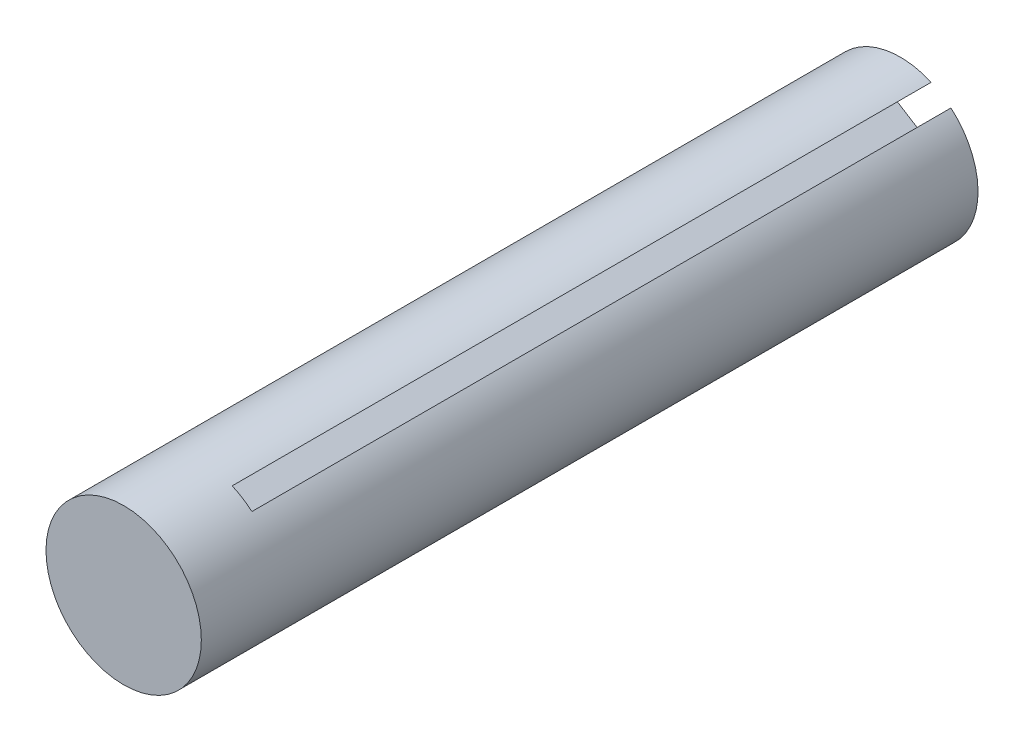
ISO-10303-21;
HEADER;
FILE_DESCRIPTION(('STEP AP214'),'2;1');
FILE_NAME('part.step','',(''),(''),'','','');
FILE_SCHEMA(('AUTOMOTIVE_DESIGN { 1 0 10303 214 1 1 1 1 }'));
ENDSEC;
DATA;
#1=APPLICATION_CONTEXT('core data for automotive mechanical design processes');
#2=APPLICATION_PROTOCOL_DEFINITION('international standard','automotive_design',2000,#1);
#3=PRODUCT_CONTEXT('',#1,'mechanical');
#4=PRODUCT('Part','Part','',(#3));
#5=PRODUCT_RELATED_PRODUCT_CATEGORY('part','',(#4));
#6=PRODUCT_DEFINITION_FORMATION('','',#4);
#7=PRODUCT_DEFINITION_CONTEXT('part definition',#1,'design');
#8=PRODUCT_DEFINITION('design','',#6,#7);
#9=PRODUCT_DEFINITION_SHAPE('','',#8);
#10=(LENGTH_UNIT() NAMED_UNIT(*) SI_UNIT(.MILLI.,.METRE.));
#11=(NAMED_UNIT(*) PLANE_ANGLE_UNIT() SI_UNIT($,.RADIAN.));
#12=(NAMED_UNIT(*) SI_UNIT($,.STERADIAN.) SOLID_ANGLE_UNIT());
#13=UNCERTAINTY_MEASURE_WITH_UNIT(LENGTH_MEASURE(1.E-05),#10,'distance_accuracy_value','');
#14=(GEOMETRIC_REPRESENTATION_CONTEXT(3) GLOBAL_UNCERTAINTY_ASSIGNED_CONTEXT((#13)) GLOBAL_UNIT_ASSIGNED_CONTEXT((#10,
#11,#12)) REPRESENTATION_CONTEXT('',''));
#15=CARTESIAN_POINT('',(0.,0.,0.));
#16=DIRECTION('',(0.,0.,1.));
#17=DIRECTION('',(1.,0.,0.));
#18=AXIS2_PLACEMENT_3D('',#15,#16,#17);
#19=CARTESIAN_POINT('',(-5.34894767701645,5.17438553068314,100.));
#20=DIRECTION('',(0.,0.,-1.));
#21=DIRECTION('',(-1.,0.,0.));
#22=AXIS2_PLACEMENT_3D('',#19,#20,#21);
#23=CYLINDRICAL_SURFACE('',#22,10.);
#24=CARTESIAN_POINT('',(-5.34894767701645,5.17438553068314,100.));
#25=DIRECTION('',(0.,0.,1.));
#26=DIRECTION('',(1.,0.,0.));
#27=AXIS2_PLACEMENT_3D('',#24,#25,#26);
#28=CIRCLE('',#27,10.);
#29=CARTESIAN_POINT('',(4.65105232298355,5.17438553068314,100.));
#30=VERTEX_POINT('',#29);
#31=EDGE_CURVE('E203',#30,#30,#28,.T.);
#32=ORIENTED_EDGE('',*,*,#31,.F.);
#33=EDGE_LOOP('',(#32));
#34=FACE_BOUND('',#33,.T.);
#35=CARTESIAN_POINT('',(-5.34894767701645,5.17438553068314,90.));
#36=DIRECTION('',(0.,0.,-1.));
#37=DIRECTION('',(-1.,0.,0.));
#38=AXIS2_PLACEMENT_3D('',#35,#36,#37);
#39=CIRCLE('',#38,10.);
#40=CARTESIAN_POINT('',(-15.2826424117407,4.02472953112816,90.));
#41=VERTEX_POINT('',#40);
#42=CARTESIAN_POINT('',(-15.1766207850004,7.02285551491592,90.));
#43=VERTEX_POINT('',#42);
#44=EDGE_CURVE('E11',#41,#43,#39,.T.);
#45=ORIENTED_EDGE('',*,*,#44,.F.);
#46=DIRECTION('',(0.,0.,-1.));
#47=VECTOR('',#46,1.);
#48=CARTESIAN_POINT('',(-15.2826424117407,4.02472953112816,90.));
#49=LINE('',#48,#47);
#50=CARTESIAN_POINT('',(-15.2826424117407,4.02472953112816,0.));
#51=VERTEX_POINT('',#50);
#52=EDGE_CURVE('E184',#41,#51,#49,.T.);
#53=ORIENTED_EDGE('',*,*,#52,.T.);
#54=CARTESIAN_POINT('',(-5.34894767701645,5.17438553068314,0.));
#55=DIRECTION('',(0.,0.,1.));
#56=DIRECTION('',(1.,0.,0.));
#57=AXIS2_PLACEMENT_3D('',#54,#55,#56);
#58=CIRCLE('',#57,10.);
#59=CARTESIAN_POINT('',(-2.03593308750304,-4.26086403303648,0.));
#60=VERTEX_POINT('',#59);
#61=EDGE_CURVE('E208',#51,#60,#58,.T.);
#62=ORIENTED_EDGE('',*,*,#61,.T.);
#63=DIRECTION('',(0.,0.,-1.));
#64=VECTOR('',#63,1.);
#65=CARTESIAN_POINT('',(-2.03593308750304,-4.26086403303648,90.));
#66=LINE('',#65,#64);
#67=CARTESIAN_POINT('',(-2.03593308750304,-4.26086403303648,90.));
#68=VERTEX_POINT('',#67);
#69=EDGE_CURVE('E46',#68,#60,#66,.T.);
#70=ORIENTED_EDGE('',*,*,#69,.F.);
#71=CARTESIAN_POINT('',(-5.34894767701645,5.17438553068314,90.));
#72=DIRECTION('',(0.,0.,-1.));
#73=DIRECTION('',(-1.,0.,0.));
#74=AXIS2_PLACEMENT_3D('',#71,#72,#73);
#75=CIRCLE('',#74,10.);
#76=CARTESIAN_POINT('',(0.6135309915735,-2.8536184632502,90.));
#77=VERTEX_POINT('',#76);
#78=EDGE_CURVE('E39',#77,#68,#75,.T.);
#79=ORIENTED_EDGE('',*,*,#78,.F.);
#80=DIRECTION('',(0.,0.,-1.));
#81=VECTOR('',#80,1.);
#82=CARTESIAN_POINT('',(0.6135309915735,-2.8536184632502,90.));
#83=LINE('',#82,#81);
#84=CARTESIAN_POINT('',(0.6135309915735,-2.8536184632502,0.));
#85=VERTEX_POINT('',#84);
#86=EDGE_CURVE('E161',#77,#85,#83,.T.);
#87=ORIENTED_EDGE('',*,*,#86,.T.);
#88=CARTESIAN_POINT('',(1.16571084145416,12.76116511017,0.));
#89=VERTEX_POINT('',#88);
#90=EDGE_CURVE('E200',#85,#89,#58,.T.);
#91=ORIENTED_EDGE('',*,*,#90,.T.);
#92=DIRECTION('',(0.,0.,-1.));
#93=VECTOR('',#92,1.);
#94=CARTESIAN_POINT('',(1.16571084145416,12.76116511017,90.));
#95=LINE('',#94,#93);
#96=CARTESIAN_POINT('',(1.16571084145416,12.76116511017,90.));
#97=VERTEX_POINT('',#96);
#98=EDGE_CURVE('E179',#97,#89,#95,.T.);
#99=ORIENTED_EDGE('',*,*,#98,.F.);
#100=CARTESIAN_POINT('',(-5.34894767701645,5.17438553068314,90.));
#101=DIRECTION('',(0.,0.,-1.));
#102=DIRECTION('',(-1.,0.,0.));
#103=AXIS2_PLACEMENT_3D('',#100,#101,#102);
#104=CIRCLE('',#103,10.);
#105=CARTESIAN_POINT('',(-1.37773161088211,14.3520455241715,90.));
#106=VERTEX_POINT('',#105);
#107=EDGE_CURVE('E206',#106,#97,#104,.T.);
#108=ORIENTED_EDGE('',*,*,#107,.F.);
#109=DIRECTION('',(0.,0.,-1.));
#110=VECTOR('',#109,1.);
#111=CARTESIAN_POINT('',(-1.37773161088211,14.3520455241715,90.));
#112=LINE('',#111,#110);
#113=CARTESIAN_POINT('',(-1.37773161088211,14.3520455241715,0.));
#114=VERTEX_POINT('',#113);
#115=EDGE_CURVE('E188',#106,#114,#112,.T.);
#116=ORIENTED_EDGE('',*,*,#115,.T.);
#117=CARTESIAN_POINT('',(-15.1766207850004,7.02285551491592,0.));
#118=VERTEX_POINT('',#117);
#119=EDGE_CURVE('E139',#114,#118,#58,.T.);
#120=ORIENTED_EDGE('',*,*,#119,.T.);
#121=DIRECTION('',(0.,0.,-1.));
#122=VECTOR('',#121,1.);
#123=CARTESIAN_POINT('',(-15.1766207850004,7.02285551491592,90.));
#124=LINE('',#123,#122);
#125=EDGE_CURVE('E54',#43,#118,#124,.T.);
#126=ORIENTED_EDGE('',*,*,#125,.F.);
#127=EDGE_LOOP('',(#45,#53,#62,#70,#79,#87,#91,#99,#108,#116,#120,#126));
#128=FACE_BOUND('',#127,.T.);
#129=ADVANCED_FACE('F32',(#34,#128),#23,.T.);
#130=CARTESIAN_POINT('',(-5.34894767701645,5.17438553068314,100.));
#131=DIRECTION('',(0.,0.,1.));
#132=DIRECTION('',(1.,0.,0.));
#133=AXIS2_PLACEMENT_3D('',#130,#131,#132);
#134=PLANE('',#133);
#135=ORIENTED_EDGE('',*,*,#31,.T.);
#136=EDGE_LOOP('',(#135));
#137=FACE_BOUND('',#136,.T.);
#138=ADVANCED_FACE('F260',(#137),#134,.T.);
#139=CARTESIAN_POINT('',(-5.34894767701645,5.17438553068314,0.));
#140=DIRECTION('',(0.,0.,1.));
#141=DIRECTION('',(1.,0.,0.));
#142=AXIS2_PLACEMENT_3D('',#139,#140,#141);
#143=PLANE('',#142);
#144=CARTESIAN_POINT('',(-5.34894767701645,5.17438553068314,0.));
#145=DIRECTION('',(0.,0.,-1.));
#146=DIRECTION('',(-1.,0.,0.));
#147=AXIS2_PLACEMENT_3D('',#144,#145,#146);
#148=CIRCLE('',#147,1.1);
#149=CARTESIAN_POINT('',(-6.44894767701645,5.17438553068314,0.));
#150=VERTEX_POINT('',#149);
#151=EDGE_CURVE('E190',#150,#150,#148,.T.);
#152=ORIENTED_EDGE('',*,*,#151,.F.);
#153=EDGE_LOOP('',(#152));
#154=FACE_BOUND('',#153,.T.);
#155=ORIENTED_EDGE('',*,*,#61,.F.);
#156=DIRECTION('',(-0.960965138717914,0.27666948181695,0.));
#157=VECTOR('',#156,1.);
#158=CARTESIAN_POINT('',(-9.33940125753525,2.31362328575388,0.));
#159=LINE('',#158,#157);
#160=CARTESIAN_POINT('',(-9.33940125753525,2.31362328575388,0.));
#161=VERTEX_POINT('',#160);
#162=EDGE_CURVE('E134',#161,#51,#159,.T.);
#163=ORIENTED_EDGE('',*,*,#162,.F.);
#164=DIRECTION('',(-0.0353405422467573,-0.999375327929255,0.));
#165=VECTOR('',#164,1.);
#166=CARTESIAN_POINT('',(-9.28639044416512,3.81268627764762,0.));
#167=LINE('',#166,#165);
#168=CARTESIAN_POINT('',(-9.12735800405473,8.30987525332912,0.));
#169=VERTEX_POINT('',#168);
#170=EDGE_CURVE('E240',#169,#161,#167,.T.);
#171=ORIENTED_EDGE('',*,*,#170,.F.);
#172=DIRECTION('',(0.978107819723793,0.20809875779343,0.));
#173=VECTOR('',#172,1.);
#174=CARTESIAN_POINT('',(-9.12735800405473,8.30987525332912,0.));
#175=LINE('',#174,#173);
#176=EDGE_CURVE('E164',#118,#169,#175,.T.);
#177=ORIENTED_EDGE('',*,*,#176,.F.);
#178=ORIENTED_EDGE('',*,*,#119,.F.);
#179=DIRECTION('',(0.720085369064332,0.693885481372456,0.));
#180=VECTOR('',#179,1.);
#181=CARTESIAN_POINT('',(-5.83121366505329,10.0606008264997,0.));
#182=LINE('',#181,#180);
#183=CARTESIAN_POINT('',(-5.83121366505329,10.0606008264997,0.));
#184=VERTEX_POINT('',#183);
#185=EDGE_CURVE('E174',#184,#114,#182,.T.);
#186=ORIENTED_EDGE('',*,*,#185,.F.);
#187=DIRECTION('',(-0.847814150778758,0.53029347133384,0.));
#188=VECTOR('',#187,1.);
#189=CARTESIAN_POINT('',(-4.55949243888515,9.26516061949894,0.));
#190=LINE('',#189,#188);
#191=CARTESIAN_POINT('',(-0.744328760380744,6.87883999849667,0.));
#192=VERTEX_POINT('',#191);
#193=EDGE_CURVE('E183',#192,#184,#190,.T.);
#194=ORIENTED_EDGE('',*,*,#193,.F.);
#195=DIRECTION('',(-0.308835099116785,-0.951115598417735,0.));
#196=VECTOR('',#195,1.);
#197=CARTESIAN_POINT('',(-0.744328760380744,6.87883999849667,0.));
#198=LINE('',#197,#196);
#199=EDGE_CURVE('E180',#89,#192,#198,.T.);
#200=ORIENTED_EDGE('',*,*,#199,.F.);
#201=ORIENTED_EDGE('',*,*,#90,.F.);
#202=DIRECTION('',(0.240879769653607,-0.970554963189425,0.));
#203=VECTOR('',#202,1.);
#204=CARTESIAN_POINT('',(-0.876228108460899,3.14893247979595,0.));
#205=LINE('',#204,#203);
#206=CARTESIAN_POINT('',(-0.876228108460899,3.14893247979595,0.));
#207=VERTEX_POINT('',#206);
#208=EDGE_CURVE('E150',#207,#85,#205,.T.);
#209=ORIENTED_EDGE('',*,*,#208,.F.);
#210=DIRECTION('',(0.883154693025514,0.469081856595424,0.));
#211=VECTOR('',#210,1.);
#212=CARTESIAN_POINT('',(-2.20096014799904,2.44530969490288,0.));
#213=LINE('',#212,#211);
#214=CARTESIAN_POINT('',(-6.17515626661373,0.334441340223541,0.));
#215=VERTEX_POINT('',#214);
#216=EDGE_CURVE('E157',#215,#207,#213,.T.);
#217=ORIENTED_EDGE('',*,*,#216,.F.);
#218=DIRECTION('',(-0.669272720606996,0.743016840624296,0.));
#219=VECTOR('',#218,1.);
#220=CARTESIAN_POINT('',(-6.17515626661373,0.334441340223541,0.));
#221=LINE('',#220,#219);
#222=EDGE_CURVE('E155',#60,#215,#221,.T.);
#223=ORIENTED_EDGE('',*,*,#222,.F.);
#224=EDGE_LOOP('',(#155,#163,#171,#177,#178,#186,#194,#200,#201,#209,#217,#223));
#225=FACE_BOUND('',#224,.T.);
#226=ADVANCED_FACE('F228',(#154,#225),#143,.F.);
#227=CARTESIAN_POINT('',(-5.34894767701645,5.17438553068314,4.));
#228=DIRECTION('',(0.,0.,-1.));
#229=DIRECTION('',(-1.,0.,0.));
#230=AXIS2_PLACEMENT_3D('',#227,#228,#229);
#231=CYLINDRICAL_SURFACE('',#230,1.1);
#232=CARTESIAN_POINT('',(-5.34894767701645,5.17438553068314,4.));
#233=DIRECTION('',(0.,0.,-1.));
#234=DIRECTION('',(-1.,0.,0.));
#235=AXIS2_PLACEMENT_3D('',#232,#233,#234);
#236=CIRCLE('',#235,1.1);
#237=CARTESIAN_POINT('',(-6.44894767701645,5.17438553068314,4.));
#238=VERTEX_POINT('',#237);
#239=EDGE_CURVE('E197',#238,#238,#236,.T.);
#240=ORIENTED_EDGE('',*,*,#239,.F.);
#241=EDGE_LOOP('',(#240));
#242=FACE_BOUND('',#241,.T.);
#243=ORIENTED_EDGE('',*,*,#151,.T.);
#244=EDGE_LOOP('',(#243));
#245=FACE_BOUND('',#244,.T.);
#246=ADVANCED_FACE('F271',(#242,#245),#231,.F.);
#247=CARTESIAN_POINT('',(-5.34894767701645,5.17438553068314,4.));
#248=DIRECTION('',(0.,0.,-1.));
#249=DIRECTION('',(-1.,0.,0.));
#250=AXIS2_PLACEMENT_3D('',#247,#248,#249);
#251=PLANE('',#250);
#252=ORIENTED_EDGE('',*,*,#239,.T.);
#253=EDGE_LOOP('',(#252));
#254=FACE_BOUND('',#253,.T.);
#255=ADVANCED_FACE('F276',(#254),#251,.T.);
#256=CARTESIAN_POINT('',(0.,0.,90.));
#257=DIRECTION('',(0.,0.,-1.));
#258=DIRECTION('',(-1.,0.,0.));
#259=AXIS2_PLACEMENT_3D('',#256,#257,#258);
#260=PLANE('',#259);
#261=ORIENTED_EDGE('',*,*,#107,.T.);
#262=DIRECTION('',(-0.308835099116785,-0.951115598417735,0.));
#263=VECTOR('',#262,1.);
#264=CARTESIAN_POINT('',(-0.744328760380744,6.87883999849667,90.));
#265=LINE('',#264,#263);
#266=CARTESIAN_POINT('',(-0.744328760380744,6.87883999849667,90.));
#267=VERTEX_POINT('',#266);
#268=EDGE_CURVE('E170',#97,#267,#265,.T.);
#269=ORIENTED_EDGE('',*,*,#268,.T.);
#270=DIRECTION('',(-0.847814150778757,0.530293471333841,0.));
#271=VECTOR('',#270,1.);
#272=CARTESIAN_POINT('',(-2.01604998654888,7.67428020549743,90.));
#273=LINE('',#272,#271);
#274=CARTESIAN_POINT('',(-5.83121366505329,10.0606008264997,90.));
#275=VERTEX_POINT('',#274);
#276=EDGE_CURVE('E173',#267,#275,#273,.T.);
#277=ORIENTED_EDGE('',*,*,#276,.T.);
#278=DIRECTION('',(0.720085369064332,0.693885481372456,0.));
#279=VECTOR('',#278,1.);
#280=CARTESIAN_POINT('',(-5.83121366505329,10.0606008264997,90.));
#281=LINE('',#280,#279);
#282=EDGE_CURVE('E176',#275,#106,#281,.T.);
#283=ORIENTED_EDGE('',*,*,#282,.T.);
#284=EDGE_LOOP('',(#261,#269,#277,#283));
#285=FACE_BOUND('',#284,.T.);
#286=ADVANCED_FACE('F236',(#285),#260,.T.);
#287=CARTESIAN_POINT('',(-5.83121366505329,10.0606008264997,90.));
#288=DIRECTION('',(-0.693885481372456,0.720085369064332,0.));
#289=DIRECTION('',(-0.720085369064332,-0.693885481372456,0.));
#290=AXIS2_PLACEMENT_3D('',#287,#288,#289);
#291=PLANE('',#290);
#292=ORIENTED_EDGE('',*,*,#185,.T.);
#293=ORIENTED_EDGE('',*,*,#115,.F.);
#294=ORIENTED_EDGE('',*,*,#282,.F.);
#295=DIRECTION('',(0.,0.,-1.));
#296=VECTOR('',#295,1.);
#297=CARTESIAN_POINT('',(-5.83121366505329,10.0606008264997,90.));
#298=LINE('',#297,#296);
#299=EDGE_CURVE('E191',#275,#184,#298,.T.);
#300=ORIENTED_EDGE('',*,*,#299,.T.);
#301=EDGE_LOOP('',(#292,#293,#294,#300));
#302=FACE_BOUND('',#301,.T.);
#303=ADVANCED_FACE('F285',(#302),#291,.F.);
#304=CARTESIAN_POINT('',(-4.55949243888515,9.26516061949894,90.));
#305=DIRECTION('',(-0.53029347133384,-0.847814150778758,0.));
#306=DIRECTION('',(0.847814150778758,-0.53029347133384,0.));
#307=AXIS2_PLACEMENT_3D('',#304,#305,#306);
#308=PLANE('',#307);
#309=ORIENTED_EDGE('',*,*,#193,.T.);
#310=ORIENTED_EDGE('',*,*,#299,.F.);
#311=ORIENTED_EDGE('',*,*,#276,.F.);
#312=DIRECTION('',(0.,0.,-1.));
#313=VECTOR('',#312,1.);
#314=CARTESIAN_POINT('',(-0.744328760380744,6.87883999849667,90.));
#315=LINE('',#314,#313);
#316=EDGE_CURVE('E193',#267,#192,#315,.T.);
#317=ORIENTED_EDGE('',*,*,#316,.T.);
#318=EDGE_LOOP('',(#309,#310,#311,#317));
#319=FACE_BOUND('',#318,.T.);
#320=ADVANCED_FACE('F232',(#319),#308,.F.);
#321=CARTESIAN_POINT('',(-0.744328760380744,6.87883999849667,90.));
#322=DIRECTION('',(0.951115598417735,-0.308835099116784,0.));
#323=DIRECTION('',(0.308835099116785,0.951115598417735,0.));
#324=AXIS2_PLACEMENT_3D('',#321,#322,#323);
#325=PLANE('',#324);
#326=ORIENTED_EDGE('',*,*,#199,.T.);
#327=ORIENTED_EDGE('',*,*,#316,.F.);
#328=ORIENTED_EDGE('',*,*,#268,.F.);
#329=ORIENTED_EDGE('',*,*,#98,.T.);
#330=EDGE_LOOP('',(#326,#327,#328,#329));
#331=FACE_BOUND('',#330,.T.);
#332=ADVANCED_FACE('F226',(#331),#325,.F.);
#333=CARTESIAN_POINT('',(0.,0.,90.));
#334=DIRECTION('',(0.,0.,-1.));
#335=DIRECTION('',(-1.,0.,0.));
#336=AXIS2_PLACEMENT_3D('',#333,#334,#335);
#337=PLANE('',#336);
#338=ORIENTED_EDGE('',*,*,#78,.T.);
#339=DIRECTION('',(-0.669272720606996,0.743016840624296,0.));
#340=VECTOR('',#339,1.);
#341=CARTESIAN_POINT('',(-6.17515626661373,0.334441340223541,90.));
#342=LINE('',#341,#340);
#343=CARTESIAN_POINT('',(-6.17515626661373,0.334441340223541,90.));
#344=VERTEX_POINT('',#343);
#345=EDGE_CURVE('E146',#68,#344,#342,.T.);
#346=ORIENTED_EDGE('',*,*,#345,.T.);
#347=DIRECTION('',(0.883154693025514,0.469081856595424,0.));
#348=VECTOR('',#347,1.);
#349=CARTESIAN_POINT('',(-4.85042422707559,1.03806412511661,90.));
#350=LINE('',#349,#348);
#351=CARTESIAN_POINT('',(-0.876228108460899,3.14893247979595,90.));
#352=VERTEX_POINT('',#351);
#353=EDGE_CURVE('E149',#344,#352,#350,.T.);
#354=ORIENTED_EDGE('',*,*,#353,.T.);
#355=DIRECTION('',(0.240879769653607,-0.970554963189425,0.));
#356=VECTOR('',#355,1.);
#357=CARTESIAN_POINT('',(-0.876228108460899,3.14893247979595,90.));
#358=LINE('',#357,#356);
#359=EDGE_CURVE('E152',#352,#77,#358,.T.);
#360=ORIENTED_EDGE('',*,*,#359,.T.);
#361=EDGE_LOOP('',(#338,#346,#354,#360));
#362=FACE_BOUND('',#361,.T.);
#363=ADVANCED_FACE('F211',(#362),#337,.T.);
#364=CARTESIAN_POINT('',(-0.876228108460899,3.14893247979595,90.));
#365=DIRECTION('',(0.970554963189425,0.240879769653607,0.));
#366=DIRECTION('',(-0.240879769653607,0.970554963189425,0.));
#367=AXIS2_PLACEMENT_3D('',#364,#365,#366);
#368=PLANE('',#367);
#369=ORIENTED_EDGE('',*,*,#208,.T.);
#370=ORIENTED_EDGE('',*,*,#86,.F.);
#371=ORIENTED_EDGE('',*,*,#359,.F.);
#372=DIRECTION('',(0.,0.,-1.));
#373=VECTOR('',#372,1.);
#374=CARTESIAN_POINT('',(-0.876228108460899,3.14893247979595,90.));
#375=LINE('',#374,#373);
#376=EDGE_CURVE('E165',#352,#207,#375,.T.);
#377=ORIENTED_EDGE('',*,*,#376,.T.);
#378=EDGE_LOOP('',(#369,#370,#371,#377));
#379=FACE_BOUND('',#378,.T.);
#380=ADVANCED_FACE('F295',(#379),#368,.F.);
#381=CARTESIAN_POINT('',(-2.20096014799904,2.44530969490288,90.));
#382=DIRECTION('',(-0.469081856595424,0.883154693025514,0.));
#383=DIRECTION('',(-0.883154693025514,-0.469081856595424,0.));
#384=AXIS2_PLACEMENT_3D('',#381,#382,#383);
#385=PLANE('',#384);
#386=ORIENTED_EDGE('',*,*,#216,.T.);
#387=ORIENTED_EDGE('',*,*,#376,.F.);
#388=ORIENTED_EDGE('',*,*,#353,.F.);
#389=DIRECTION('',(0.,0.,-1.));
#390=VECTOR('',#389,1.);
#391=CARTESIAN_POINT('',(-6.17515626661373,0.334441340223541,90.));
#392=LINE('',#391,#390);
#393=EDGE_CURVE('E167',#344,#215,#392,.T.);
#394=ORIENTED_EDGE('',*,*,#393,.T.);
#395=EDGE_LOOP('',(#386,#387,#388,#394));
#396=FACE_BOUND('',#395,.T.);
#397=ADVANCED_FACE('F292',(#396),#385,.F.);
#398=CARTESIAN_POINT('',(-6.17515626661373,0.334441340223541,90.));
#399=DIRECTION('',(-0.743016840624296,-0.669272720606995,0.));
#400=DIRECTION('',(0.669272720606996,-0.743016840624296,0.));
#401=AXIS2_PLACEMENT_3D('',#398,#399,#400);
#402=PLANE('',#401);
#403=ORIENTED_EDGE('',*,*,#222,.T.);
#404=ORIENTED_EDGE('',*,*,#393,.F.);
#405=ORIENTED_EDGE('',*,*,#345,.F.);
#406=ORIENTED_EDGE('',*,*,#69,.T.);
#407=EDGE_LOOP('',(#403,#404,#405,#406));
#408=FACE_BOUND('',#407,.T.);
#409=ADVANCED_FACE('F213',(#408),#402,.F.);
#410=CARTESIAN_POINT('',(0.,0.,90.));
#411=DIRECTION('',(0.,0.,-1.));
#412=DIRECTION('',(-1.,0.,0.));
#413=AXIS2_PLACEMENT_3D('',#410,#411,#412);
#414=PLANE('',#413);
#415=ORIENTED_EDGE('',*,*,#44,.T.);
#416=DIRECTION('',(0.978107819723793,0.20809875779343,0.));
#417=VECTOR('',#416,1.);
#418=CARTESIAN_POINT('',(-9.12735800405473,8.30987525332912,90.));
#419=LINE('',#418,#417);
#420=CARTESIAN_POINT('',(-9.12735800405473,8.30987525332912,90.));
#421=VERTEX_POINT('',#420);
#422=EDGE_CURVE('E125',#43,#421,#419,.T.);
#423=ORIENTED_EDGE('',*,*,#422,.T.);
#424=DIRECTION('',(-0.0353405422467561,-0.999375327929255,0.));
#425=VECTOR('',#424,1.);
#426=CARTESIAN_POINT('',(-9.18036881742485,6.81081226143538,90.));
#427=LINE('',#426,#425);
#428=CARTESIAN_POINT('',(-9.33940125753525,2.31362328575388,90.));
#429=VERTEX_POINT('',#428);
#430=EDGE_CURVE('E133',#421,#429,#427,.T.);
#431=ORIENTED_EDGE('',*,*,#430,.T.);
#432=DIRECTION('',(-0.960965138717914,0.27666948181695,0.));
#433=VECTOR('',#432,1.);
#434=CARTESIAN_POINT('',(-9.33940125753525,2.31362328575388,90.));
#435=LINE('',#434,#433);
#436=EDGE_CURVE('E127',#429,#41,#435,.T.);
#437=ORIENTED_EDGE('',*,*,#436,.T.);
#438=EDGE_LOOP('',(#415,#423,#431,#437));
#439=FACE_BOUND('',#438,.T.);
#440=ADVANCED_FACE('F124',(#439),#414,.T.);
#441=CARTESIAN_POINT('',(-9.33940125753525,2.31362328575388,90.));
#442=DIRECTION('',(-0.27666948181695,-0.960965138717914,0.));
#443=DIRECTION('',(0.960965138717914,-0.27666948181695,0.));
#444=AXIS2_PLACEMENT_3D('',#441,#442,#443);
#445=PLANE('',#444);
#446=ORIENTED_EDGE('',*,*,#162,.T.);
#447=ORIENTED_EDGE('',*,*,#52,.F.);
#448=ORIENTED_EDGE('',*,*,#436,.F.);
#449=DIRECTION('',(0.,0.,-1.));
#450=VECTOR('',#449,1.);
#451=CARTESIAN_POINT('',(-9.33940125753525,2.31362328575388,90.));
#452=LINE('',#451,#450);
#453=EDGE_CURVE('E141',#429,#161,#452,.T.);
#454=ORIENTED_EDGE('',*,*,#453,.T.);
#455=EDGE_LOOP('',(#446,#447,#448,#454));
#456=FACE_BOUND('',#455,.T.);
#457=ADVANCED_FACE('F248',(#456),#445,.F.);
#458=CARTESIAN_POINT('',(-9.28639044416512,3.81268627764762,90.));
#459=DIRECTION('',(0.999375327929255,-0.0353405422467573,0.));
#460=DIRECTION('',(0.0353405422467573,0.999375327929255,0.));
#461=AXIS2_PLACEMENT_3D('',#458,#459,#460);
#462=PLANE('',#461);
#463=ORIENTED_EDGE('',*,*,#170,.T.);
#464=ORIENTED_EDGE('',*,*,#453,.F.);
#465=ORIENTED_EDGE('',*,*,#430,.F.);
#466=DIRECTION('',(0.,0.,-1.));
#467=VECTOR('',#466,1.);
#468=CARTESIAN_POINT('',(-9.12735800405473,8.30987525332912,90.));
#469=LINE('',#468,#467);
#470=EDGE_CURVE('E131',#421,#169,#469,.T.);
#471=ORIENTED_EDGE('',*,*,#470,.T.);
#472=EDGE_LOOP('',(#463,#464,#465,#471));
#473=FACE_BOUND('',#472,.T.);
#474=ADVANCED_FACE('F250',(#473),#462,.F.);
#475=CARTESIAN_POINT('',(-9.12735800405473,8.30987525332912,90.));
#476=DIRECTION('',(-0.20809875779343,0.978107819723793,0.));
#477=DIRECTION('',(-0.978107819723793,-0.20809875779343,0.));
#478=AXIS2_PLACEMENT_3D('',#475,#476,#477);
#479=PLANE('',#478);
#480=ORIENTED_EDGE('',*,*,#176,.T.);
#481=ORIENTED_EDGE('',*,*,#470,.F.);
#482=ORIENTED_EDGE('',*,*,#422,.F.);
#483=ORIENTED_EDGE('',*,*,#125,.T.);
#484=EDGE_LOOP('',(#480,#481,#482,#483));
#485=FACE_BOUND('',#484,.T.);
#486=ADVANCED_FACE('F130',(#485),#479,.F.);
#487=CLOSED_SHELL('',(#129,#138,#226,#246,#255,#286,#303,#320,#332,#363,#380,#397,#409,#440,
#457,#474,#486));
#488=MANIFOLD_SOLID_BREP('B2',#487);
#489=ADVANCED_BREP_SHAPE_REPRESENTATION('',(#18,#488),#14);
#490=SHAPE_DEFINITION_REPRESENTATION(#9,#489);
ENDSEC;
END-ISO-10303-21;
